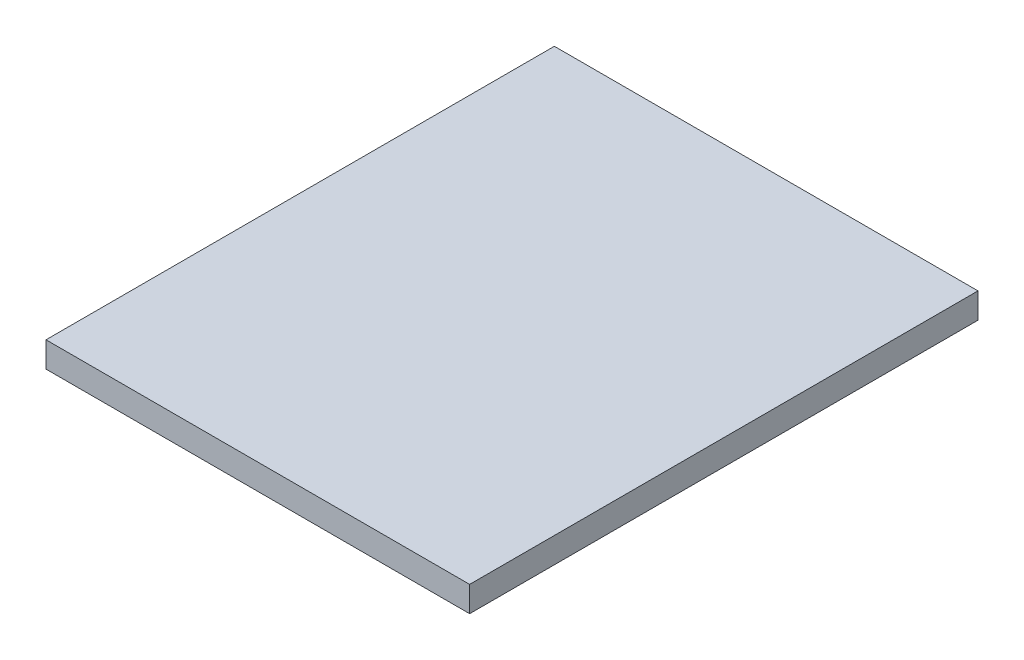
ISO-10303-21;
HEADER;
FILE_DESCRIPTION(('STEP AP214'),'2;1');
FILE_NAME('part.step','',(''),(''),'','','');
FILE_SCHEMA(('AUTOMOTIVE_DESIGN { 1 0 10303 214 1 1 1 1 }'));
ENDSEC;
DATA;
#1=APPLICATION_CONTEXT('core data for automotive mechanical design processes');
#2=APPLICATION_PROTOCOL_DEFINITION('international standard','automotive_design',2000,#1);
#3=PRODUCT_CONTEXT('',#1,'mechanical');
#4=PRODUCT('Part','Part','',(#3));
#5=PRODUCT_RELATED_PRODUCT_CATEGORY('part','',(#4));
#6=PRODUCT_DEFINITION_FORMATION('','',#4);
#7=PRODUCT_DEFINITION_CONTEXT('part definition',#1,'design');
#8=PRODUCT_DEFINITION('design','',#6,#7);
#9=PRODUCT_DEFINITION_SHAPE('','',#8);
#10=(LENGTH_UNIT() NAMED_UNIT(*) SI_UNIT(.MILLI.,.METRE.));
#11=(NAMED_UNIT(*) PLANE_ANGLE_UNIT() SI_UNIT($,.RADIAN.));
#12=(NAMED_UNIT(*) SI_UNIT($,.STERADIAN.) SOLID_ANGLE_UNIT());
#13=UNCERTAINTY_MEASURE_WITH_UNIT(LENGTH_MEASURE(1.E-05),#10,'distance_accuracy_value','');
#14=(GEOMETRIC_REPRESENTATION_CONTEXT(3) GLOBAL_UNCERTAINTY_ASSIGNED_CONTEXT((#13)) GLOBAL_UNIT_ASSIGNED_CONTEXT((#10,
#11,#12)) REPRESENTATION_CONTEXT('',''));
#15=CARTESIAN_POINT('',(0.,0.,0.));
#16=DIRECTION('',(0.,0.,1.));
#17=DIRECTION('',(1.,0.,0.));
#18=AXIS2_PLACEMENT_3D('',#15,#16,#17);
#19=CARTESIAN_POINT('',(-90.8045977011493,6.,-75.5747126436782));
#20=DIRECTION('',(1.,0.,0.));
#21=DIRECTION('',(0.,0.,-1.));
#22=AXIS2_PLACEMENT_3D('',#19,#20,#21);
#23=PLANE('',#22);
#24=DIRECTION('',(0.,0.,1.));
#25=VECTOR('',#24,1.);
#26=CARTESIAN_POINT('',(-90.8045977011493,0.,-75.5747126436782));
#27=LINE('',#26,#25);
#28=CARTESIAN_POINT('',(-90.8045977011493,0.,-75.5747126436782));
#29=VERTEX_POINT('',#28);
#30=CARTESIAN_POINT('',(-90.8045977011493,0.,44.4252873563218));
#31=VERTEX_POINT('',#30);
#32=EDGE_CURVE('E107',#29,#31,#27,.T.);
#33=ORIENTED_EDGE('',*,*,#32,.T.);
#34=DIRECTION('',(0.,-1.,0.));
#35=VECTOR('',#34,1.);
#36=CARTESIAN_POINT('',(-90.8045977011493,6.,44.4252873563218));
#37=LINE('',#36,#35);
#38=CARTESIAN_POINT('',(-90.8045977011493,6.,44.4252873563218));
#39=VERTEX_POINT('',#38);
#40=EDGE_CURVE('E11',#39,#31,#37,.T.);
#41=ORIENTED_EDGE('',*,*,#40,.F.);
#42=DIRECTION('',(0.,0.,1.));
#43=VECTOR('',#42,1.);
#44=CARTESIAN_POINT('',(-90.8045977011493,6.,-75.5747126436782));
#45=LINE('',#44,#43);
#46=CARTESIAN_POINT('',(-90.8045977011493,6.,-75.5747126436782));
#47=VERTEX_POINT('',#46);
#48=EDGE_CURVE('E91',#47,#39,#45,.T.);
#49=ORIENTED_EDGE('',*,*,#48,.F.);
#50=DIRECTION('',(0.,-1.,0.));
#51=VECTOR('',#50,1.);
#52=CARTESIAN_POINT('',(-90.8045977011493,6.,-75.5747126436782));
#53=LINE('',#52,#51);
#54=EDGE_CURVE('E103',#47,#29,#53,.T.);
#55=ORIENTED_EDGE('',*,*,#54,.T.);
#56=EDGE_LOOP('',(#33,#41,#49,#55));
#57=FACE_BOUND('',#56,.T.);
#58=ADVANCED_FACE('F39',(#57),#23,.F.);
#59=CARTESIAN_POINT('',(-90.8045977011493,6.,44.4252873563218));
#60=DIRECTION('',(0.,0.,-1.));
#61=DIRECTION('',(-1.,0.,0.));
#62=AXIS2_PLACEMENT_3D('',#59,#60,#61);
#63=PLANE('',#62);
#64=DIRECTION('',(1.,0.,0.));
#65=VECTOR('',#64,1.);
#66=CARTESIAN_POINT('',(-90.8045977011493,0.,44.4252873563218));
#67=LINE('',#66,#65);
#68=CARTESIAN_POINT('',(9.19540229885073,0.,44.4252873563218));
#69=VERTEX_POINT('',#68);
#70=EDGE_CURVE('E96',#31,#69,#67,.T.);
#71=ORIENTED_EDGE('',*,*,#70,.T.);
#72=DIRECTION('',(0.,-1.,0.));
#73=VECTOR('',#72,1.);
#74=CARTESIAN_POINT('',(9.19540229885073,6.,44.4252873563218));
#75=LINE('',#74,#73);
#76=CARTESIAN_POINT('',(9.19540229885073,6.,44.4252873563218));
#77=VERTEX_POINT('',#76);
#78=EDGE_CURVE('E48',#77,#69,#75,.T.);
#79=ORIENTED_EDGE('',*,*,#78,.F.);
#80=DIRECTION('',(1.,0.,0.));
#81=VECTOR('',#80,1.);
#82=CARTESIAN_POINT('',(-90.8045977011493,6.,44.4252873563218));
#83=LINE('',#82,#81);
#84=EDGE_CURVE('E86',#39,#77,#83,.T.);
#85=ORIENTED_EDGE('',*,*,#84,.F.);
#86=ORIENTED_EDGE('',*,*,#40,.T.);
#87=EDGE_LOOP('',(#71,#79,#85,#86));
#88=FACE_BOUND('',#87,.T.);
#89=ADVANCED_FACE('F95',(#88),#63,.F.);
#90=CARTESIAN_POINT('',(9.19540229885071,6.,-75.5747126436782));
#91=DIRECTION('',(-1.,0.,0.));
#92=DIRECTION('',(0.,0.,1.));
#93=AXIS2_PLACEMENT_3D('',#90,#91,#92);
#94=PLANE('',#93);
#95=DIRECTION('',(0.,0.,-1.));
#96=VECTOR('',#95,1.);
#97=CARTESIAN_POINT('',(9.19540229885071,0.,-75.5747126436782));
#98=LINE('',#97,#96);
#99=CARTESIAN_POINT('',(9.19540229885071,0.,-75.5747126436782));
#100=VERTEX_POINT('',#99);
#101=EDGE_CURVE('E73',#69,#100,#98,.T.);
#102=ORIENTED_EDGE('',*,*,#101,.T.);
#103=DIRECTION('',(0.,-1.,0.));
#104=VECTOR('',#103,1.);
#105=CARTESIAN_POINT('',(9.19540229885071,6.,-75.5747126436782));
#106=LINE('',#105,#104);
#107=CARTESIAN_POINT('',(9.19540229885071,6.,-75.5747126436782));
#108=VERTEX_POINT('',#107);
#109=EDGE_CURVE('E98',#108,#100,#106,.T.);
#110=ORIENTED_EDGE('',*,*,#109,.F.);
#111=DIRECTION('',(0.,0.,-1.));
#112=VECTOR('',#111,1.);
#113=CARTESIAN_POINT('',(9.19540229885071,6.,-75.5747126436782));
#114=LINE('',#113,#112);
#115=EDGE_CURVE('E89',#77,#108,#114,.T.);
#116=ORIENTED_EDGE('',*,*,#115,.F.);
#117=ORIENTED_EDGE('',*,*,#78,.T.);
#118=EDGE_LOOP('',(#102,#110,#116,#117));
#119=FACE_BOUND('',#118,.T.);
#120=ADVANCED_FACE('F99',(#119),#94,.F.);
#121=CARTESIAN_POINT('',(-90.8045977011493,6.,-75.5747126436782));
#122=DIRECTION('',(0.,0.,1.));
#123=DIRECTION('',(1.,0.,0.));
#124=AXIS2_PLACEMENT_3D('',#121,#122,#123);
#125=PLANE('',#124);
#126=DIRECTION('',(-1.,0.,0.));
#127=VECTOR('',#126,1.);
#128=CARTESIAN_POINT('',(-90.8045977011493,0.,-75.5747126436782));
#129=LINE('',#128,#127);
#130=EDGE_CURVE('E79',#100,#29,#129,.T.);
#131=ORIENTED_EDGE('',*,*,#130,.T.);
#132=ORIENTED_EDGE('',*,*,#54,.F.);
#133=DIRECTION('',(-1.,0.,0.));
#134=VECTOR('',#133,1.);
#135=CARTESIAN_POINT('',(-90.8045977011493,6.,-75.5747126436782));
#136=LINE('',#135,#134);
#137=EDGE_CURVE('E56',#108,#47,#136,.T.);
#138=ORIENTED_EDGE('',*,*,#137,.F.);
#139=ORIENTED_EDGE('',*,*,#109,.T.);
#140=EDGE_LOOP('',(#131,#132,#138,#139));
#141=FACE_BOUND('',#140,.T.);
#142=ADVANCED_FACE('F120',(#141),#125,.F.);
#143=CARTESIAN_POINT('',(0.,6.,0.));
#144=DIRECTION('',(0.,1.,0.));
#145=DIRECTION('',(0.,0.,1.));
#146=AXIS2_PLACEMENT_3D('',#143,#144,#145);
#147=PLANE('',#146);
#148=ORIENTED_EDGE('',*,*,#48,.T.);
#149=ORIENTED_EDGE('',*,*,#84,.T.);
#150=ORIENTED_EDGE('',*,*,#115,.T.);
#151=ORIENTED_EDGE('',*,*,#137,.T.);
#152=EDGE_LOOP('',(#148,#149,#150,#151));
#153=FACE_BOUND('',#152,.T.);
#154=ADVANCED_FACE('F87',(#153),#147,.T.);
#155=CARTESIAN_POINT('',(0.,0.,0.));
#156=DIRECTION('',(0.,1.,0.));
#157=DIRECTION('',(0.,0.,1.));
#158=AXIS2_PLACEMENT_3D('',#155,#156,#157);
#159=PLANE('',#158);
#160=ORIENTED_EDGE('',*,*,#32,.F.);
#161=ORIENTED_EDGE('',*,*,#130,.F.);
#162=ORIENTED_EDGE('',*,*,#101,.F.);
#163=ORIENTED_EDGE('',*,*,#70,.F.);
#164=EDGE_LOOP('',(#160,#161,#162,#163));
#165=FACE_BOUND('',#164,.T.);
#166=ADVANCED_FACE('F123',(#165),#159,.F.);
#167=CLOSED_SHELL('',(#58,#89,#120,#142,#154,#166));
#168=MANIFOLD_SOLID_BREP('B2',#167);
#169=ADVANCED_BREP_SHAPE_REPRESENTATION('',(#18,#168),#14);
#170=SHAPE_DEFINITION_REPRESENTATION(#9,#169);
ENDSEC;
END-ISO-10303-21;
